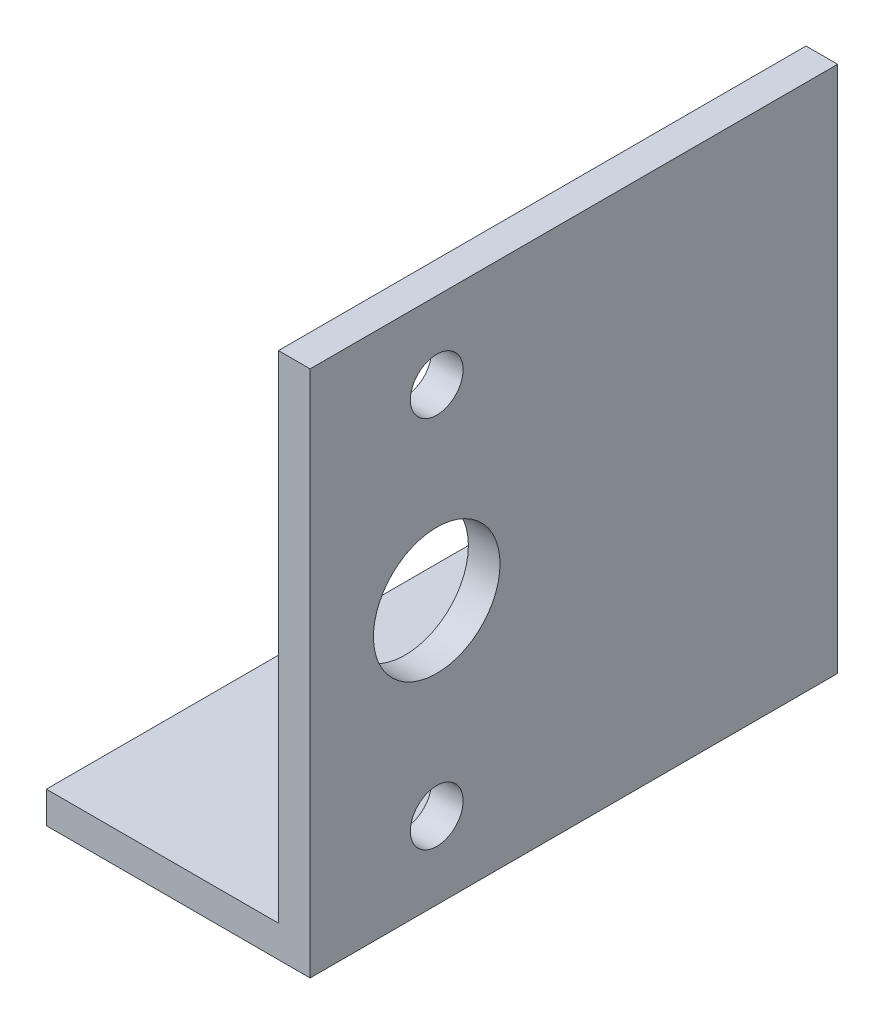
ISO-10303-21;
HEADER;
FILE_DESCRIPTION(('STEP AP214'),'2;1');
FILE_NAME('part.step','',(''),(''),'','','');
FILE_SCHEMA(('AUTOMOTIVE_DESIGN { 1 0 10303 214 1 1 1 1 }'));
ENDSEC;
DATA;
#1=APPLICATION_CONTEXT('core data for automotive mechanical design processes');
#2=APPLICATION_PROTOCOL_DEFINITION('international standard','automotive_design',2000,#1);
#3=PRODUCT_CONTEXT('',#1,'mechanical');
#4=PRODUCT('Part','Part','',(#3));
#5=PRODUCT_RELATED_PRODUCT_CATEGORY('part','',(#4));
#6=PRODUCT_DEFINITION_FORMATION('','',#4);
#7=PRODUCT_DEFINITION_CONTEXT('part definition',#1,'design');
#8=PRODUCT_DEFINITION('design','',#6,#7);
#9=PRODUCT_DEFINITION_SHAPE('','',#8);
#10=(LENGTH_UNIT() NAMED_UNIT(*) SI_UNIT(.MILLI.,.METRE.));
#11=(NAMED_UNIT(*) PLANE_ANGLE_UNIT() SI_UNIT($,.RADIAN.));
#12=(NAMED_UNIT(*) SI_UNIT($,.STERADIAN.) SOLID_ANGLE_UNIT());
#13=UNCERTAINTY_MEASURE_WITH_UNIT(LENGTH_MEASURE(1.E-05),#10,'distance_accuracy_value','');
#14=(GEOMETRIC_REPRESENTATION_CONTEXT(3) GLOBAL_UNCERTAINTY_ASSIGNED_CONTEXT((#13)) GLOBAL_UNIT_ASSIGNED_CONTEXT((#10,
#11,#12)) REPRESENTATION_CONTEXT('',''));
#15=CARTESIAN_POINT('',(0.,0.,0.));
#16=DIRECTION('',(0.,0.,1.));
#17=DIRECTION('',(1.,0.,0.));
#18=AXIS2_PLACEMENT_3D('',#15,#16,#17);
#19=CARTESIAN_POINT('',(-25.,3.,50.));
#20=DIRECTION('',(1.,0.,0.));
#21=DIRECTION('',(0.,0.,-1.));
#22=AXIS2_PLACEMENT_3D('',#19,#20,#21);
#23=PLANE('',#22);
#24=DIRECTION('',(0.,-1.,0.));
#25=VECTOR('',#24,1.);
#26=CARTESIAN_POINT('',(-25.,3.,0.));
#27=LINE('',#26,#25);
#28=CARTESIAN_POINT('',(-25.,3.,0.));
#29=VERTEX_POINT('',#28);
#30=CARTESIAN_POINT('',(-25.,0.,0.));
#31=VERTEX_POINT('',#30);
#32=EDGE_CURVE('E120',#29,#31,#27,.T.);
#33=ORIENTED_EDGE('',*,*,#32,.T.);
#34=DIRECTION('',(0.,0.,-1.));
#35=VECTOR('',#34,1.);
#36=CARTESIAN_POINT('',(-25.,0.,50.));
#37=LINE('',#36,#35);
#38=CARTESIAN_POINT('',(-25.,0.,50.));
#39=VERTEX_POINT('',#38);
#40=EDGE_CURVE('E11',#39,#31,#37,.T.);
#41=ORIENTED_EDGE('',*,*,#40,.F.);
#42=DIRECTION('',(0.,-1.,0.));
#43=VECTOR('',#42,1.);
#44=CARTESIAN_POINT('',(-25.,3.,50.));
#45=LINE('',#44,#43);
#46=CARTESIAN_POINT('',(-25.,3.,50.));
#47=VERTEX_POINT('',#46);
#48=EDGE_CURVE('E131',#47,#39,#45,.T.);
#49=ORIENTED_EDGE('',*,*,#48,.F.);
#50=DIRECTION('',(0.,0.,-1.));
#51=VECTOR('',#50,1.);
#52=CARTESIAN_POINT('',(-25.,3.,50.));
#53=LINE('',#52,#51);
#54=EDGE_CURVE('E116',#47,#29,#53,.T.);
#55=ORIENTED_EDGE('',*,*,#54,.T.);
#56=EDGE_LOOP('',(#33,#41,#49,#55));
#57=FACE_BOUND('',#56,.T.);
#58=ADVANCED_FACE('F36',(#57),#23,.F.);
#59=CARTESIAN_POINT('',(-25.,0.,50.));
#60=DIRECTION('',(0.,1.,0.));
#61=DIRECTION('',(0.,0.,1.));
#62=AXIS2_PLACEMENT_3D('',#59,#60,#61);
#63=PLANE('',#62);
#64=DIRECTION('',(1.,0.,0.));
#65=VECTOR('',#64,1.);
#66=CARTESIAN_POINT('',(-25.,0.,0.));
#67=LINE('',#66,#65);
#68=CARTESIAN_POINT('',(0.,0.,0.));
#69=VERTEX_POINT('',#68);
#70=EDGE_CURVE('E123',#31,#69,#67,.T.);
#71=ORIENTED_EDGE('',*,*,#70,.T.);
#72=DIRECTION('',(0.,0.,-1.));
#73=VECTOR('',#72,1.);
#74=CARTESIAN_POINT('',(0.,0.,50.));
#75=LINE('',#74,#73);
#76=CARTESIAN_POINT('',(0.,0.,50.));
#77=VERTEX_POINT('',#76);
#78=EDGE_CURVE('E44',#77,#69,#75,.T.);
#79=ORIENTED_EDGE('',*,*,#78,.F.);
#80=DIRECTION('',(1.,0.,0.));
#81=VECTOR('',#80,1.);
#82=CARTESIAN_POINT('',(-25.,0.,50.));
#83=LINE('',#82,#81);
#84=EDGE_CURVE('E89',#39,#77,#83,.T.);
#85=ORIENTED_EDGE('',*,*,#84,.F.);
#86=ORIENTED_EDGE('',*,*,#40,.T.);
#87=EDGE_LOOP('',(#71,#79,#85,#86));
#88=FACE_BOUND('',#87,.T.);
#89=ADVANCED_FACE('F156',(#88),#63,.F.);
#90=CARTESIAN_POINT('',(0.,0.,50.));
#91=DIRECTION('',(-1.,0.,0.));
#92=DIRECTION('',(0.,0.,1.));
#93=AXIS2_PLACEMENT_3D('',#90,#91,#92);
#94=PLANE('',#93);
#95=CARTESIAN_POINT('',(0.,7.3,38.));
#96=DIRECTION('',(1.,0.,0.));
#97=DIRECTION('',(0.,0.,-1.));
#98=AXIS2_PLACEMENT_3D('',#95,#96,#97);
#99=CIRCLE('',#98,2.5);
#100=CARTESIAN_POINT('',(0.,7.3,35.5));
#101=VERTEX_POINT('',#100);
#102=EDGE_CURVE('E234',#101,#101,#99,.T.);
#103=ORIENTED_EDGE('',*,*,#102,.F.);
#104=EDGE_LOOP('',(#103));
#105=FACE_BOUND('',#104,.T.);
#106=CARTESIAN_POINT('',(0.,42.7,38.));
#107=DIRECTION('',(1.,0.,0.));
#108=DIRECTION('',(0.,0.,-1.));
#109=AXIS2_PLACEMENT_3D('',#106,#107,#108);
#110=CIRCLE('',#109,2.5);
#111=CARTESIAN_POINT('',(0.,42.7,35.5));
#112=VERTEX_POINT('',#111);
#113=EDGE_CURVE('E236',#112,#112,#110,.T.);
#114=ORIENTED_EDGE('',*,*,#113,.F.);
#115=EDGE_LOOP('',(#114));
#116=FACE_BOUND('',#115,.T.);
#117=CARTESIAN_POINT('',(0.,25.,38.));
#118=DIRECTION('',(1.,0.,0.));
#119=DIRECTION('',(0.,0.,-1.));
#120=AXIS2_PLACEMENT_3D('',#117,#118,#119);
#121=CIRCLE('',#120,6.);
#122=CARTESIAN_POINT('',(0.,25.,32.));
#123=VERTEX_POINT('',#122);
#124=EDGE_CURVE('E242',#123,#123,#121,.T.);
#125=ORIENTED_EDGE('',*,*,#124,.F.);
#126=EDGE_LOOP('',(#125));
#127=FACE_BOUND('',#126,.T.);
#128=DIRECTION('',(0.,1.,0.));
#129=VECTOR('',#128,1.);
#130=CARTESIAN_POINT('',(0.,0.,0.));
#131=LINE('',#130,#129);
#132=CARTESIAN_POINT('',(0.,50.,0.));
#133=VERTEX_POINT('',#132);
#134=EDGE_CURVE('E126',#69,#133,#131,.T.);
#135=ORIENTED_EDGE('',*,*,#134,.T.);
#136=DIRECTION('',(0.,0.,-1.));
#137=VECTOR('',#136,1.);
#138=CARTESIAN_POINT('',(0.,50.,50.));
#139=LINE('',#138,#137);
#140=CARTESIAN_POINT('',(0.,50.,50.));
#141=VERTEX_POINT('',#140);
#142=EDGE_CURVE('E111',#141,#133,#139,.T.);
#143=ORIENTED_EDGE('',*,*,#142,.F.);
#144=DIRECTION('',(0.,1.,0.));
#145=VECTOR('',#144,1.);
#146=CARTESIAN_POINT('',(0.,0.,50.));
#147=LINE('',#146,#145);
#148=EDGE_CURVE('E102',#77,#141,#147,.T.);
#149=ORIENTED_EDGE('',*,*,#148,.F.);
#150=ORIENTED_EDGE('',*,*,#78,.T.);
#151=EDGE_LOOP('',(#135,#143,#149,#150));
#152=FACE_BOUND('',#151,.T.);
#153=ADVANCED_FACE('F137',(#105,#116,#127,#152),#94,.F.);
#154=CARTESIAN_POINT('',(-3.,50.,50.));
#155=DIRECTION('',(0.,-1.,0.));
#156=DIRECTION('',(0.,0.,-1.));
#157=AXIS2_PLACEMENT_3D('',#154,#155,#156);
#158=PLANE('',#157);
#159=DIRECTION('',(-1.,0.,0.));
#160=VECTOR('',#159,1.);
#161=CARTESIAN_POINT('',(-3.,50.,0.));
#162=LINE('',#161,#160);
#163=CARTESIAN_POINT('',(-3.,50.,0.));
#164=VERTEX_POINT('',#163);
#165=EDGE_CURVE('E110',#133,#164,#162,.T.);
#166=ORIENTED_EDGE('',*,*,#165,.T.);
#167=DIRECTION('',(0.,0.,-1.));
#168=VECTOR('',#167,1.);
#169=CARTESIAN_POINT('',(-3.,50.,50.));
#170=LINE('',#169,#168);
#171=CARTESIAN_POINT('',(-3.,50.,50.));
#172=VERTEX_POINT('',#171);
#173=EDGE_CURVE('E107',#172,#164,#170,.T.);
#174=ORIENTED_EDGE('',*,*,#173,.F.);
#175=DIRECTION('',(-1.,0.,0.));
#176=VECTOR('',#175,1.);
#177=CARTESIAN_POINT('',(-3.,50.,50.));
#178=LINE('',#177,#176);
#179=EDGE_CURVE('E96',#141,#172,#178,.T.);
#180=ORIENTED_EDGE('',*,*,#179,.F.);
#181=ORIENTED_EDGE('',*,*,#142,.T.);
#182=EDGE_LOOP('',(#166,#174,#180,#181));
#183=FACE_BOUND('',#182,.T.);
#184=ADVANCED_FACE('F108',(#183),#158,.F.);
#185=CARTESIAN_POINT('',(-3.,3.,50.));
#186=DIRECTION('',(1.,0.,0.));
#187=DIRECTION('',(0.,0.,-1.));
#188=AXIS2_PLACEMENT_3D('',#185,#186,#187);
#189=PLANE('',#188);
#190=CARTESIAN_POINT('',(-3.,7.3,38.));
#191=DIRECTION('',(1.,0.,0.));
#192=DIRECTION('',(0.,0.,-1.));
#193=AXIS2_PLACEMENT_3D('',#190,#191,#192);
#194=CIRCLE('',#193,2.5);
#195=CARTESIAN_POINT('',(-3.,7.3,35.5));
#196=VERTEX_POINT('',#195);
#197=EDGE_CURVE('E231',#196,#196,#194,.F.);
#198=ORIENTED_EDGE('',*,*,#197,.F.);
#199=EDGE_LOOP('',(#198));
#200=FACE_BOUND('',#199,.T.);
#201=CARTESIAN_POINT('',(-3.,42.7,38.));
#202=DIRECTION('',(1.,0.,0.));
#203=DIRECTION('',(0.,0.,-1.));
#204=AXIS2_PLACEMENT_3D('',#201,#202,#203);
#205=CIRCLE('',#204,2.5);
#206=CARTESIAN_POINT('',(-3.,42.7,35.5));
#207=VERTEX_POINT('',#206);
#208=EDGE_CURVE('E239',#207,#207,#205,.F.);
#209=ORIENTED_EDGE('',*,*,#208,.F.);
#210=EDGE_LOOP('',(#209));
#211=FACE_BOUND('',#210,.T.);
#212=CARTESIAN_POINT('',(-3.,25.,38.));
#213=DIRECTION('',(1.,0.,0.));
#214=DIRECTION('',(0.,0.,-1.));
#215=AXIS2_PLACEMENT_3D('',#212,#213,#214);
#216=CIRCLE('',#215,6.);
#217=CARTESIAN_POINT('',(-3.,25.,32.));
#218=VERTEX_POINT('',#217);
#219=EDGE_CURVE('E124',#218,#218,#216,.F.);
#220=ORIENTED_EDGE('',*,*,#219,.F.);
#221=EDGE_LOOP('',(#220));
#222=FACE_BOUND('',#221,.T.);
#223=DIRECTION('',(0.,-1.,0.));
#224=VECTOR('',#223,1.);
#225=CARTESIAN_POINT('',(-3.,3.,0.));
#226=LINE('',#225,#224);
#227=CARTESIAN_POINT('',(-3.,3.,0.));
#228=VERTEX_POINT('',#227);
#229=EDGE_CURVE('E75',#164,#228,#226,.T.);
#230=ORIENTED_EDGE('',*,*,#229,.T.);
#231=DIRECTION('',(0.,0.,-1.));
#232=VECTOR('',#231,1.);
#233=CARTESIAN_POINT('',(-3.,3.,50.));
#234=LINE('',#233,#232);
#235=CARTESIAN_POINT('',(-3.,3.,50.));
#236=VERTEX_POINT('',#235);
#237=EDGE_CURVE('E112',#236,#228,#234,.T.);
#238=ORIENTED_EDGE('',*,*,#237,.F.);
#239=DIRECTION('',(0.,-1.,0.));
#240=VECTOR('',#239,1.);
#241=CARTESIAN_POINT('',(-3.,3.,50.));
#242=LINE('',#241,#240);
#243=EDGE_CURVE('E100',#172,#236,#242,.T.);
#244=ORIENTED_EDGE('',*,*,#243,.F.);
#245=ORIENTED_EDGE('',*,*,#173,.T.);
#246=EDGE_LOOP('',(#230,#238,#244,#245));
#247=FACE_BOUND('',#246,.T.);
#248=ADVANCED_FACE('F114',(#200,#211,#222,#247),#189,.F.);
#249=CARTESIAN_POINT('',(-25.,3.,50.));
#250=DIRECTION('',(0.,-1.,0.));
#251=DIRECTION('',(0.,0.,-1.));
#252=AXIS2_PLACEMENT_3D('',#249,#250,#251);
#253=PLANE('',#252);
#254=DIRECTION('',(-1.,0.,0.));
#255=VECTOR('',#254,1.);
#256=CARTESIAN_POINT('',(-25.,3.,0.));
#257=LINE('',#256,#255);
#258=EDGE_CURVE('E81',#228,#29,#257,.T.);
#259=ORIENTED_EDGE('',*,*,#258,.T.);
#260=ORIENTED_EDGE('',*,*,#54,.F.);
#261=DIRECTION('',(-1.,0.,0.));
#262=VECTOR('',#261,1.);
#263=CARTESIAN_POINT('',(-25.,3.,50.));
#264=LINE('',#263,#262);
#265=EDGE_CURVE('E52',#236,#47,#264,.T.);
#266=ORIENTED_EDGE('',*,*,#265,.F.);
#267=ORIENTED_EDGE('',*,*,#237,.T.);
#268=EDGE_LOOP('',(#259,#260,#266,#267));
#269=FACE_BOUND('',#268,.T.);
#270=ADVANCED_FACE('F144',(#269),#253,.F.);
#271=CARTESIAN_POINT('',(0.,0.,50.));
#272=DIRECTION('',(0.,0.,1.));
#273=DIRECTION('',(1.,0.,0.));
#274=AXIS2_PLACEMENT_3D('',#271,#272,#273);
#275=PLANE('',#274);
#276=ORIENTED_EDGE('',*,*,#48,.T.);
#277=ORIENTED_EDGE('',*,*,#84,.T.);
#278=ORIENTED_EDGE('',*,*,#148,.T.);
#279=ORIENTED_EDGE('',*,*,#179,.T.);
#280=ORIENTED_EDGE('',*,*,#243,.T.);
#281=ORIENTED_EDGE('',*,*,#265,.T.);
#282=EDGE_LOOP('',(#276,#277,#278,#279,#280,#281));
#283=FACE_BOUND('',#282,.T.);
#284=ADVANCED_FACE('F98',(#283),#275,.T.);
#285=CARTESIAN_POINT('',(0.,0.,0.));
#286=DIRECTION('',(0.,0.,1.));
#287=DIRECTION('',(1.,0.,0.));
#288=AXIS2_PLACEMENT_3D('',#285,#286,#287);
#289=PLANE('',#288);
#290=ORIENTED_EDGE('',*,*,#32,.F.);
#291=ORIENTED_EDGE('',*,*,#258,.F.);
#292=ORIENTED_EDGE('',*,*,#229,.F.);
#293=ORIENTED_EDGE('',*,*,#165,.F.);
#294=ORIENTED_EDGE('',*,*,#134,.F.);
#295=ORIENTED_EDGE('',*,*,#70,.F.);
#296=EDGE_LOOP('',(#290,#291,#292,#293,#294,#295));
#297=FACE_BOUND('',#296,.T.);
#298=ADVANCED_FACE('F140',(#297),#289,.F.);
#299=CARTESIAN_POINT('',(-19.9705627484771,25.,38.));
#300=DIRECTION('',(1.,0.,0.));
#301=DIRECTION('',(0.,0.,-1.));
#302=AXIS2_PLACEMENT_3D('',#299,#300,#301);
#303=CYLINDRICAL_SURFACE('',#302,6.);
#304=ORIENTED_EDGE('',*,*,#219,.T.);
#305=EDGE_LOOP('',(#304));
#306=FACE_BOUND('',#305,.T.);
#307=ORIENTED_EDGE('',*,*,#124,.T.);
#308=EDGE_LOOP('',(#307));
#309=FACE_BOUND('',#308,.T.);
#310=ADVANCED_FACE('F184',(#306,#309),#303,.F.);
#311=CARTESIAN_POINT('',(-19.9705627484771,42.7,38.));
#312=DIRECTION('',(1.,0.,0.));
#313=DIRECTION('',(0.,0.,-1.));
#314=AXIS2_PLACEMENT_3D('',#311,#312,#313);
#315=CYLINDRICAL_SURFACE('',#314,2.5);
#316=ORIENTED_EDGE('',*,*,#208,.T.);
#317=EDGE_LOOP('',(#316));
#318=FACE_BOUND('',#317,.T.);
#319=ORIENTED_EDGE('',*,*,#113,.T.);
#320=EDGE_LOOP('',(#319));
#321=FACE_BOUND('',#320,.T.);
#322=ADVANCED_FACE('F189',(#318,#321),#315,.F.);
#323=CARTESIAN_POINT('',(-19.9705627484771,7.3,38.));
#324=DIRECTION('',(1.,0.,0.));
#325=DIRECTION('',(0.,0.,-1.));
#326=AXIS2_PLACEMENT_3D('',#323,#324,#325);
#327=CYLINDRICAL_SURFACE('',#326,2.5);
#328=ORIENTED_EDGE('',*,*,#197,.T.);
#329=EDGE_LOOP('',(#328));
#330=FACE_BOUND('',#329,.T.);
#331=ORIENTED_EDGE('',*,*,#102,.T.);
#332=EDGE_LOOP('',(#331));
#333=FACE_BOUND('',#332,.T.);
#334=ADVANCED_FACE('F201',(#330,#333),#327,.F.);
#335=CLOSED_SHELL('',(#58,#89,#153,#184,#248,#270,#284,#298,#310,#322,#334));
#336=MANIFOLD_SOLID_BREP('B2',#335);
#337=ADVANCED_BREP_SHAPE_REPRESENTATION('',(#18,#336),#14);
#338=SHAPE_DEFINITION_REPRESENTATION(#9,#337);
ENDSEC;
END-ISO-10303-21;
